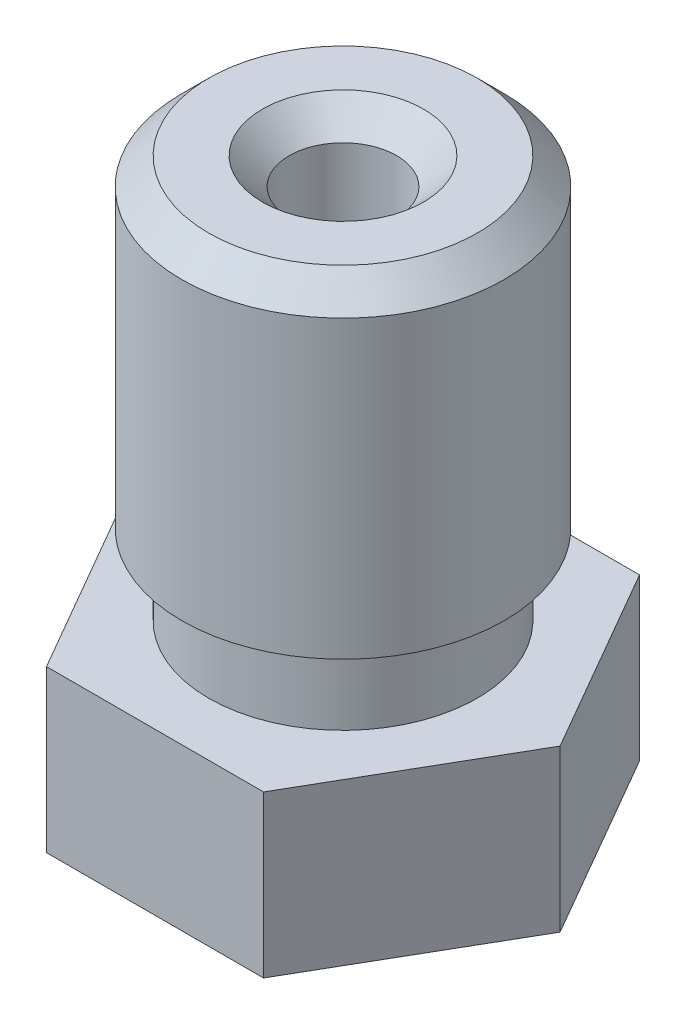
ISO-10303-21;
HEADER;
FILE_DESCRIPTION(('STEP AP214'),'2;1');
FILE_NAME('part.step','',(''),(''),'','','');
FILE_SCHEMA(('AUTOMOTIVE_DESIGN { 1 0 10303 214 1 1 1 1 }'));
ENDSEC;
DATA;
#1=APPLICATION_CONTEXT('core data for automotive mechanical design processes');
#2=APPLICATION_PROTOCOL_DEFINITION('international standard','automotive_design',2000,#1);
#3=PRODUCT_CONTEXT('',#1,'mechanical');
#4=PRODUCT('Part','Part','',(#3));
#5=PRODUCT_RELATED_PRODUCT_CATEGORY('part','',(#4));
#6=PRODUCT_DEFINITION_FORMATION('','',#4);
#7=PRODUCT_DEFINITION_CONTEXT('part definition',#1,'design');
#8=PRODUCT_DEFINITION('design','',#6,#7);
#9=PRODUCT_DEFINITION_SHAPE('','',#8);
#10=(LENGTH_UNIT() NAMED_UNIT(*) SI_UNIT(.MILLI.,.METRE.));
#11=(NAMED_UNIT(*) PLANE_ANGLE_UNIT() SI_UNIT($,.RADIAN.));
#12=(NAMED_UNIT(*) SI_UNIT($,.STERADIAN.) SOLID_ANGLE_UNIT());
#13=UNCERTAINTY_MEASURE_WITH_UNIT(LENGTH_MEASURE(1.E-05),#10,'distance_accuracy_value','');
#14=(GEOMETRIC_REPRESENTATION_CONTEXT(3) GLOBAL_UNCERTAINTY_ASSIGNED_CONTEXT((#13)) GLOBAL_UNIT_ASSIGNED_CONTEXT((#10,
#11,#12)) REPRESENTATION_CONTEXT('',''));
#15=CARTESIAN_POINT('',(0.,0.,0.));
#16=DIRECTION('',(0.,0.,1.));
#17=DIRECTION('',(1.,0.,0.));
#18=AXIS2_PLACEMENT_3D('',#15,#16,#17);
#19=CARTESIAN_POINT('',(-4.04245188432738,3.,-3.501));
#20=DIRECTION('',(0.,1.,0.));
#21=DIRECTION('',(0.,0.,1.));
#22=AXIS2_PLACEMENT_3D('',#19,#20,#21);
#23=PLANE('',#22);
#24=CARTESIAN_POINT('',(0.,3.,0.));
#25=DIRECTION('',(0.,-1.,0.));
#26=DIRECTION('',(0.,0.,-1.));
#27=AXIS2_PLACEMENT_3D('',#24,#25,#26);
#28=CIRCLE('',#27,2.5);
#29=CARTESIAN_POINT('',(0.,3.,-2.5));
#30=VERTEX_POINT('',#29);
#31=EDGE_CURVE('E20',#30,#30,#28,.F.);
#32=ORIENTED_EDGE('',*,*,#31,.F.);
#33=EDGE_LOOP('',(#32));
#34=FACE_BOUND('',#33,.T.);
#35=DIRECTION('',(0.499999999999999,0.,-0.866025403784439));
#36=VECTOR('',#35,1.);
#37=CARTESIAN_POINT('',(-3.03108891324554,3.,-1.75));
#38=LINE('',#37,#36);
#39=CARTESIAN_POINT('',(-4.04145188425521,3.,-1.24999058973485E-10));
#40=VERTEX_POINT('',#39);
#41=CARTESIAN_POINT('',(-2.02072594216369,3.,-3.5));
#42=VERTEX_POINT('',#41);
#43=EDGE_CURVE('E129',#40,#42,#38,.T.);
#44=ORIENTED_EDGE('',*,*,#43,.F.);
#45=DIRECTION('',(-0.5,0.,-0.866025403784439));
#46=VECTOR('',#45,1.);
#47=CARTESIAN_POINT('',(-3.03108891324554,3.,1.75));
#48=LINE('',#47,#46);
#49=CARTESIAN_POINT('',(-2.02072594216369,3.,3.5));
#50=VERTEX_POINT('',#49);
#51=EDGE_CURVE('E125',#50,#40,#48,.T.);
#52=ORIENTED_EDGE('',*,*,#51,.F.);
#53=DIRECTION('',(-1.,0.,0.));
#54=VECTOR('',#53,1.);
#55=CARTESIAN_POINT('',(0.,3.,3.5));
#56=LINE('',#55,#54);
#57=CARTESIAN_POINT('',(2.02072594216369,3.,3.5));
#58=VERTEX_POINT('',#57);
#59=EDGE_CURVE('E101',#58,#50,#56,.T.);
#60=ORIENTED_EDGE('',*,*,#59,.F.);
#61=DIRECTION('',(-0.499999999999999,0.,0.866025403784439));
#62=VECTOR('',#61,1.);
#63=CARTESIAN_POINT('',(3.03108891324554,3.,1.75));
#64=LINE('',#63,#62);
#65=CARTESIAN_POINT('',(4.04145188425521,3.,1.24999523671937E-10));
#66=VERTEX_POINT('',#65);
#67=EDGE_CURVE('E98',#66,#58,#64,.T.);
#68=ORIENTED_EDGE('',*,*,#67,.F.);
#69=DIRECTION('',(0.5,0.,0.866025403784439));
#70=VECTOR('',#69,1.);
#71=CARTESIAN_POINT('',(3.03108891324554,3.,-1.75));
#72=LINE('',#71,#70);
#73=CARTESIAN_POINT('',(2.02072594216369,3.,-3.5));
#74=VERTEX_POINT('',#73);
#75=EDGE_CURVE('E89',#74,#66,#72,.T.);
#76=ORIENTED_EDGE('',*,*,#75,.F.);
#77=DIRECTION('',(1.,0.,0.));
#78=VECTOR('',#77,1.);
#79=CARTESIAN_POINT('',(0.,3.,-3.5));
#80=LINE('',#79,#78);
#81=EDGE_CURVE('E134',#42,#74,#80,.T.);
#82=ORIENTED_EDGE('',*,*,#81,.F.);
#83=EDGE_LOOP('',(#44,#52,#60,#68,#76,#82));
#84=FACE_BOUND('',#83,.T.);
#85=ADVANCED_FACE('F16',(#34,#84),#23,.T.);
#86=CARTESIAN_POINT('',(-2.02172594216369,-0.000999999999999891,3.5));
#87=DIRECTION('',(0.,0.,1.));
#88=DIRECTION('',(1.,0.,0.));
#89=AXIS2_PLACEMENT_3D('',#86,#87,#88);
#90=PLANE('',#89);
#91=ORIENTED_EDGE('',*,*,#59,.T.);
#92=DIRECTION('',(0.,1.,0.));
#93=VECTOR('',#92,1.);
#94=CARTESIAN_POINT('',(-2.02072594216369,1.5,3.5));
#95=LINE('',#94,#93);
#96=CARTESIAN_POINT('',(-2.02072594216369,0.,3.5));
#97=VERTEX_POINT('',#96);
#98=EDGE_CURVE('E60',#97,#50,#95,.T.);
#99=ORIENTED_EDGE('',*,*,#98,.F.);
#100=DIRECTION('',(-1.,0.,0.));
#101=VECTOR('',#100,1.);
#102=CARTESIAN_POINT('',(0.,0.,3.5));
#103=LINE('',#102,#101);
#104=CARTESIAN_POINT('',(2.02072594216369,0.,3.5));
#105=VERTEX_POINT('',#104);
#106=EDGE_CURVE('E67',#105,#97,#103,.T.);
#107=ORIENTED_EDGE('',*,*,#106,.F.);
#108=DIRECTION('',(0.,-1.,0.));
#109=VECTOR('',#108,1.);
#110=CARTESIAN_POINT('',(2.02072594216369,1.5,3.5));
#111=LINE('',#110,#109);
#112=EDGE_CURVE('E104',#58,#105,#111,.T.);
#113=ORIENTED_EDGE('',*,*,#112,.F.);
#114=EDGE_LOOP('',(#91,#99,#107,#113));
#115=FACE_BOUND('',#114,.T.);
#116=ADVANCED_FACE('F223',(#115),#90,.T.);
#117=CARTESIAN_POINT('',(-4.04195188432738,-0.00100000000000044,-0.00086602540378341));
#118=DIRECTION('',(-0.866025403784439,0.,0.5));
#119=DIRECTION('',(0.5,0.,0.866025403784439));
#120=AXIS2_PLACEMENT_3D('',#117,#118,#119);
#121=PLANE('',#120);
#122=ORIENTED_EDGE('',*,*,#51,.T.);
#123=DIRECTION('',(0.,1.,0.));
#124=VECTOR('',#123,1.);
#125=CARTESIAN_POINT('',(-4.04145188432738,1.5,0.));
#126=LINE('',#125,#124);
#127=CARTESIAN_POINT('',(-4.04145188432738,0.,0.));
#128=VERTEX_POINT('',#127);
#129=EDGE_CURVE('E126',#128,#40,#126,.T.);
#130=ORIENTED_EDGE('',*,*,#129,.F.);
#131=DIRECTION('',(-0.5,0.,-0.866025403784438));
#132=VECTOR('',#131,1.);
#133=CARTESIAN_POINT('',(-2.02072594216369,0.,3.5));
#134=LINE('',#133,#132);
#135=EDGE_CURVE('E120',#97,#128,#134,.T.);
#136=ORIENTED_EDGE('',*,*,#135,.F.);
#137=ORIENTED_EDGE('',*,*,#98,.T.);
#138=EDGE_LOOP('',(#122,#130,#136,#137));
#139=FACE_BOUND('',#138,.T.);
#140=ADVANCED_FACE('F181',(#139),#121,.T.);
#141=CARTESIAN_POINT('',(-2.02022594216369,-0.000999999999999891,-3.50086602540379));
#142=DIRECTION('',(-0.866025403784439,0.,-0.499999999999999));
#143=DIRECTION('',(-0.499999999999999,0.,0.866025403784439));
#144=AXIS2_PLACEMENT_3D('',#141,#142,#143);
#145=PLANE('',#144);
#146=ORIENTED_EDGE('',*,*,#43,.T.);
#147=DIRECTION('',(0.,1.,0.));
#148=VECTOR('',#147,1.);
#149=CARTESIAN_POINT('',(-2.02072594216369,1.5,-3.5));
#150=LINE('',#149,#148);
#151=CARTESIAN_POINT('',(-2.02072594216369,0.,-3.5));
#152=VERTEX_POINT('',#151);
#153=EDGE_CURVE('E130',#152,#42,#150,.T.);
#154=ORIENTED_EDGE('',*,*,#153,.F.);
#155=DIRECTION('',(0.5,0.,-0.866025403784439));
#156=VECTOR('',#155,1.);
#157=CARTESIAN_POINT('',(-4.04145188432738,0.,0.));
#158=LINE('',#157,#156);
#159=EDGE_CURVE('E171',#128,#152,#158,.T.);
#160=ORIENTED_EDGE('',*,*,#159,.F.);
#161=ORIENTED_EDGE('',*,*,#129,.T.);
#162=EDGE_LOOP('',(#146,#154,#160,#161));
#163=FACE_BOUND('',#162,.T.);
#164=ADVANCED_FACE('F183',(#163),#145,.T.);
#165=CARTESIAN_POINT('',(2.02172594216369,-0.000999999999999891,-3.5));
#166=DIRECTION('',(0.,0.,-1.));
#167=DIRECTION('',(-1.,0.,0.));
#168=AXIS2_PLACEMENT_3D('',#165,#166,#167);
#169=PLANE('',#168);
#170=ORIENTED_EDGE('',*,*,#81,.T.);
#171=DIRECTION('',(0.,1.,0.));
#172=VECTOR('',#171,1.);
#173=CARTESIAN_POINT('',(2.02072594216369,1.5,-3.5));
#174=LINE('',#173,#172);
#175=CARTESIAN_POINT('',(2.02072594216369,0.,-3.5));
#176=VERTEX_POINT('',#175);
#177=EDGE_CURVE('E92',#176,#74,#174,.T.);
#178=ORIENTED_EDGE('',*,*,#177,.F.);
#179=DIRECTION('',(1.,0.,0.));
#180=VECTOR('',#179,1.);
#181=CARTESIAN_POINT('',(0.,0.,-3.5));
#182=LINE('',#181,#180);
#183=EDGE_CURVE('E116',#152,#176,#182,.T.);
#184=ORIENTED_EDGE('',*,*,#183,.F.);
#185=ORIENTED_EDGE('',*,*,#153,.T.);
#186=EDGE_LOOP('',(#170,#178,#184,#185));
#187=FACE_BOUND('',#186,.T.);
#188=ADVANCED_FACE('F186',(#187),#169,.T.);
#189=CARTESIAN_POINT('',(4.04195188432738,-0.000999999999999891,0.000866025403784064));
#190=DIRECTION('',(0.866025403784439,0.,-0.5));
#191=DIRECTION('',(-0.5,0.,-0.866025403784439));
#192=AXIS2_PLACEMENT_3D('',#189,#190,#191);
#193=PLANE('',#192);
#194=ORIENTED_EDGE('',*,*,#75,.T.);
#195=DIRECTION('',(0.,1.,0.));
#196=VECTOR('',#195,1.);
#197=CARTESIAN_POINT('',(4.04145188432738,1.5,0.));
#198=LINE('',#197,#196);
#199=CARTESIAN_POINT('',(4.04145188432738,0.,0.));
#200=VERTEX_POINT('',#199);
#201=EDGE_CURVE('E40',#200,#66,#198,.T.);
#202=ORIENTED_EDGE('',*,*,#201,.F.);
#203=DIRECTION('',(0.5,0.,0.866025403784439));
#204=VECTOR('',#203,1.);
#205=CARTESIAN_POINT('',(2.02072594216369,0.,-3.5));
#206=LINE('',#205,#204);
#207=EDGE_CURVE('E168',#176,#200,#206,.T.);
#208=ORIENTED_EDGE('',*,*,#207,.F.);
#209=ORIENTED_EDGE('',*,*,#177,.T.);
#210=EDGE_LOOP('',(#194,#202,#208,#209));
#211=FACE_BOUND('',#210,.T.);
#212=ADVANCED_FACE('F91',(#211),#193,.T.);
#213=CARTESIAN_POINT('',(2.02022594216369,-0.000999999999999891,3.50086602540379));
#214=DIRECTION('',(0.866025403784439,0.,0.499999999999999));
#215=DIRECTION('',(0.499999999999999,0.,-0.866025403784439));
#216=AXIS2_PLACEMENT_3D('',#213,#214,#215);
#217=PLANE('',#216);
#218=ORIENTED_EDGE('',*,*,#67,.T.);
#219=ORIENTED_EDGE('',*,*,#112,.T.);
#220=DIRECTION('',(-0.5,0.,0.866025403784439));
#221=VECTOR('',#220,1.);
#222=CARTESIAN_POINT('',(4.04145188432738,0.,0.));
#223=LINE('',#222,#221);
#224=EDGE_CURVE('E108',#200,#105,#223,.T.);
#225=ORIENTED_EDGE('',*,*,#224,.F.);
#226=ORIENTED_EDGE('',*,*,#201,.T.);
#227=EDGE_LOOP('',(#218,#219,#225,#226));
#228=FACE_BOUND('',#227,.T.);
#229=ADVANCED_FACE('F106',(#228),#217,.T.);
#230=CARTESIAN_POINT('',(0.,4.5,0.));
#231=DIRECTION('',(0.,-1.,0.));
#232=DIRECTION('',(0.,0.,-1.));
#233=AXIS2_PLACEMENT_3D('',#230,#231,#232);
#234=CYLINDRICAL_SURFACE('',#233,2.5);
#235=ORIENTED_EDGE('',*,*,#31,.T.);
#236=EDGE_LOOP('',(#235));
#237=FACE_BOUND('',#236,.T.);
#238=CARTESIAN_POINT('',(0.,4.5,0.));
#239=DIRECTION('',(0.,-1.,0.));
#240=DIRECTION('',(0.,0.,-1.));
#241=AXIS2_PLACEMENT_3D('',#238,#239,#240);
#242=CIRCLE('',#241,2.5);
#243=CARTESIAN_POINT('',(0.,4.5,-2.5));
#244=VERTEX_POINT('',#243);
#245=EDGE_CURVE('E162',#244,#244,#242,.F.);
#246=ORIENTED_EDGE('',*,*,#245,.F.);
#247=EDGE_LOOP('',(#246));
#248=FACE_BOUND('',#247,.T.);
#249=ADVANCED_FACE('F283',(#237,#248),#234,.T.);
#250=CARTESIAN_POINT('',(-4.04245188432738,0.,3.501));
#251=DIRECTION('',(0.,-1.,0.));
#252=DIRECTION('',(0.,0.,-1.));
#253=AXIS2_PLACEMENT_3D('',#250,#251,#252);
#254=PLANE('',#253);
#255=CARTESIAN_POINT('',(0.,0.,0.));
#256=DIRECTION('',(0.,1.,0.));
#257=DIRECTION('',(0.,0.,1.));
#258=AXIS2_PLACEMENT_3D('',#255,#256,#257);
#259=CIRCLE('',#258,2.49999999999999);
#260=CARTESIAN_POINT('',(0.,0.,2.49999999999999));
#261=VERTEX_POINT('',#260);
#262=EDGE_CURVE('E158',#261,#261,#259,.F.);
#263=ORIENTED_EDGE('',*,*,#262,.F.);
#264=EDGE_LOOP('',(#263));
#265=FACE_BOUND('',#264,.T.);
#266=ORIENTED_EDGE('',*,*,#207,.T.);
#267=ORIENTED_EDGE('',*,*,#224,.T.);
#268=ORIENTED_EDGE('',*,*,#106,.T.);
#269=ORIENTED_EDGE('',*,*,#135,.T.);
#270=ORIENTED_EDGE('',*,*,#159,.T.);
#271=ORIENTED_EDGE('',*,*,#183,.T.);
#272=EDGE_LOOP('',(#266,#267,#268,#269,#270,#271));
#273=FACE_BOUND('',#272,.T.);
#274=ADVANCED_FACE('F177',(#265,#273),#254,.T.);
#275=CARTESIAN_POINT('',(-3.001,4.5,3.001));
#276=DIRECTION('',(0.,-1.,0.));
#277=DIRECTION('',(0.,0.,-1.));
#278=AXIS2_PLACEMENT_3D('',#275,#276,#277);
#279=PLANE('',#278);
#280=ORIENTED_EDGE('',*,*,#245,.T.);
#281=EDGE_LOOP('',(#280));
#282=FACE_BOUND('',#281,.T.);
#283=CARTESIAN_POINT('',(0.,4.5,0.));
#284=DIRECTION('',(0.,-1.,0.));
#285=DIRECTION('',(0.,0.,-1.));
#286=AXIS2_PLACEMENT_3D('',#283,#284,#285);
#287=CIRCLE('',#286,3.);
#288=CARTESIAN_POINT('',(0.,4.5,-3.));
#289=VERTEX_POINT('',#288);
#290=EDGE_CURVE('E154',#289,#289,#287,.F.);
#291=ORIENTED_EDGE('',*,*,#290,.F.);
#292=EDGE_LOOP('',(#291));
#293=FACE_BOUND('',#292,.T.);
#294=ADVANCED_FACE('F278',(#282,#293),#279,.T.);
#295=CARTESIAN_POINT('',(0.,0.,0.));
#296=DIRECTION('',(0.,1.,0.));
#297=DIRECTION('',(0.,0.,1.));
#298=AXIS2_PLACEMENT_3D('',#295,#296,#297);
#299=CONICAL_SURFACE('',#298,2.49999999999999,0.785398163397446);
#300=CARTESIAN_POINT('',(0.,-2.,0.));
#301=DIRECTION('',(0.,1.,0.));
#302=DIRECTION('',(0.,0.,1.));
#303=AXIS2_PLACEMENT_3D('',#300,#301,#302);
#304=CIRCLE('',#303,0.5);
#305=CARTESIAN_POINT('',(0.,-2.,0.5));
#306=VERTEX_POINT('',#305);
#307=EDGE_CURVE('E150',#306,#306,#304,.F.);
#308=ORIENTED_EDGE('',*,*,#307,.F.);
#309=EDGE_LOOP('',(#308));
#310=FACE_BOUND('',#309,.T.);
#311=ORIENTED_EDGE('',*,*,#262,.T.);
#312=EDGE_LOOP('',(#311));
#313=FACE_BOUND('',#312,.T.);
#314=ADVANCED_FACE('F275',(#310,#313),#299,.T.);
#315=CARTESIAN_POINT('',(0.,10.,0.));
#316=DIRECTION('',(0.,-1.,0.));
#317=DIRECTION('',(0.,0.,-1.));
#318=AXIS2_PLACEMENT_3D('',#315,#316,#317);
#319=CYLINDRICAL_SURFACE('',#318,3.);
#320=ORIENTED_EDGE('',*,*,#290,.T.);
#321=EDGE_LOOP('',(#320));
#322=FACE_BOUND('',#321,.T.);
#323=CARTESIAN_POINT('',(0.,10.,0.));
#324=DIRECTION('',(0.,1.,0.));
#325=DIRECTION('',(0.,0.,1.));
#326=AXIS2_PLACEMENT_3D('',#323,#324,#325);
#327=CIRCLE('',#326,3.);
#328=CARTESIAN_POINT('',(0.,10.,3.));
#329=VERTEX_POINT('',#328);
#330=EDGE_CURVE('E149',#329,#329,#327,.T.);
#331=ORIENTED_EDGE('',*,*,#330,.F.);
#332=EDGE_LOOP('',(#331));
#333=FACE_BOUND('',#332,.T.);
#334=ADVANCED_FACE('F271',(#322,#333),#319,.T.);
#335=CARTESIAN_POINT('',(-0.501,-2.,0.501));
#336=DIRECTION('',(0.,-1.,0.));
#337=DIRECTION('',(0.,0.,-1.));
#338=AXIS2_PLACEMENT_3D('',#335,#336,#337);
#339=PLANE('',#338);
#340=CARTESIAN_POINT('',(0.,-2.,0.));
#341=DIRECTION('',(0.,1.,0.));
#342=DIRECTION('',(0.,0.,1.));
#343=AXIS2_PLACEMENT_3D('',#340,#341,#342);
#344=CIRCLE('',#343,0.2);
#345=CARTESIAN_POINT('',(0.,-2.,0.2));
#346=VERTEX_POINT('',#345);
#347=EDGE_CURVE('E145',#346,#346,#344,.F.);
#348=ORIENTED_EDGE('',*,*,#347,.F.);
#349=EDGE_LOOP('',(#348));
#350=FACE_BOUND('',#349,.T.);
#351=ORIENTED_EDGE('',*,*,#307,.T.);
#352=EDGE_LOOP('',(#351));
#353=FACE_BOUND('',#352,.T.);
#354=ADVANCED_FACE('F268',(#350,#353),#339,.T.);
#355=CARTESIAN_POINT('',(0.,10.,0.));
#356=DIRECTION('',(0.,-1.,0.));
#357=DIRECTION('',(0.,0.,-1.));
#358=AXIS2_PLACEMENT_3D('',#355,#356,#357);
#359=CONICAL_SURFACE('',#358,3.,0.785398163397448);
#360=CARTESIAN_POINT('',(0.,10.5,0.));
#361=DIRECTION('',(0.,-1.,0.));
#362=DIRECTION('',(0.,0.,-1.));
#363=AXIS2_PLACEMENT_3D('',#360,#361,#362);
#364=CIRCLE('',#363,2.5);
#365=CARTESIAN_POINT('',(0.,10.5,-2.5));
#366=VERTEX_POINT('',#365);
#367=EDGE_CURVE('E141',#366,#366,#364,.F.);
#368=ORIENTED_EDGE('',*,*,#367,.F.);
#369=EDGE_LOOP('',(#368));
#370=FACE_BOUND('',#369,.T.);
#371=ORIENTED_EDGE('',*,*,#330,.T.);
#372=EDGE_LOOP('',(#371));
#373=FACE_BOUND('',#372,.T.);
#374=ADVANCED_FACE('F264',(#370,#373),#359,.T.);
#375=CARTESIAN_POINT('',(0.,-2.,0.));
#376=DIRECTION('',(0.,1.,0.));
#377=DIRECTION('',(0.,0.,1.));
#378=AXIS2_PLACEMENT_3D('',#375,#376,#377);
#379=CYLINDRICAL_SURFACE('',#378,0.2);
#380=CARTESIAN_POINT('',(0.,-1.2,0.));
#381=DIRECTION('',(0.,-1.,0.));
#382=DIRECTION('',(0.,0.,-1.));
#383=AXIS2_PLACEMENT_3D('',#380,#381,#382);
#384=CIRCLE('',#383,0.2);
#385=CARTESIAN_POINT('',(0.,-1.2,-0.2));
#386=VERTEX_POINT('',#385);
#387=EDGE_CURVE('E140',#386,#386,#384,.T.);
#388=ORIENTED_EDGE('',*,*,#387,.F.);
#389=EDGE_LOOP('',(#388));
#390=FACE_BOUND('',#389,.T.);
#391=ORIENTED_EDGE('',*,*,#347,.T.);
#392=EDGE_LOOP('',(#391));
#393=FACE_BOUND('',#392,.T.);
#394=ADVANCED_FACE('F261',(#390,#393),#379,.F.);
#395=CARTESIAN_POINT('',(-2.501,10.5,-2.501));
#396=DIRECTION('',(0.,1.,0.));
#397=DIRECTION('',(0.,0.,1.));
#398=AXIS2_PLACEMENT_3D('',#395,#396,#397);
#399=PLANE('',#398);
#400=CARTESIAN_POINT('',(0.,10.5,0.));
#401=DIRECTION('',(0.,1.,0.));
#402=DIRECTION('',(0.,0.,1.));
#403=AXIS2_PLACEMENT_3D('',#400,#401,#402);
#404=CIRCLE('',#403,1.5);
#405=CARTESIAN_POINT('',(0.,10.5,1.5));
#406=VERTEX_POINT('',#405);
#407=EDGE_CURVE('E135',#406,#406,#404,.T.);
#408=ORIENTED_EDGE('',*,*,#407,.F.);
#409=EDGE_LOOP('',(#408));
#410=FACE_BOUND('',#409,.T.);
#411=ORIENTED_EDGE('',*,*,#367,.T.);
#412=EDGE_LOOP('',(#411));
#413=FACE_BOUND('',#412,.T.);
#414=ADVANCED_FACE('F257',(#410,#413),#399,.T.);
#415=CARTESIAN_POINT('',(0.,-1.2,0.));
#416=DIRECTION('',(0.,1.,0.));
#417=DIRECTION('',(0.,0.,1.));
#418=AXIS2_PLACEMENT_3D('',#415,#416,#417);
#419=CONICAL_SURFACE('',#418,0.2,0.832981266674434);
#420=CARTESIAN_POINT('',(0.,-0.700000000000002,0.));
#421=DIRECTION('',(0.,-1.,0.));
#422=DIRECTION('',(0.,0.,-1.));
#423=AXIS2_PLACEMENT_3D('',#420,#421,#422);
#424=CIRCLE('',#423,0.75);
#425=CARTESIAN_POINT('',(0.,-0.700000000000002,-0.75));
#426=VERTEX_POINT('',#425);
#427=EDGE_CURVE('E139',#426,#426,#424,.T.);
#428=ORIENTED_EDGE('',*,*,#427,.F.);
#429=EDGE_LOOP('',(#428));
#430=FACE_BOUND('',#429,.T.);
#431=ORIENTED_EDGE('',*,*,#387,.T.);
#432=EDGE_LOOP('',(#431));
#433=FACE_BOUND('',#432,.T.);
#434=ADVANCED_FACE('F254',(#430,#433),#419,.F.);
#435=CARTESIAN_POINT('',(0.,10.,0.));
#436=DIRECTION('',(0.,1.,0.));
#437=DIRECTION('',(0.,0.,1.));
#438=AXIS2_PLACEMENT_3D('',#435,#436,#437);
#439=CONICAL_SURFACE('',#438,1.,0.785398163397448);
#440=ORIENTED_EDGE('',*,*,#407,.T.);
#441=EDGE_LOOP('',(#440));
#442=FACE_BOUND('',#441,.T.);
#443=CARTESIAN_POINT('',(0.,10.,0.));
#444=DIRECTION('',(0.,1.,0.));
#445=DIRECTION('',(0.,0.,1.));
#446=AXIS2_PLACEMENT_3D('',#443,#444,#445);
#447=CIRCLE('',#446,1.);
#448=CARTESIAN_POINT('',(0.,10.,1.));
#449=VERTEX_POINT('',#448);
#450=EDGE_CURVE('E206',#449,#449,#447,.T.);
#451=ORIENTED_EDGE('',*,*,#450,.F.);
#452=EDGE_LOOP('',(#451));
#453=FACE_BOUND('',#452,.T.);
#454=ADVANCED_FACE('F250',(#442,#453),#439,.F.);
#455=CARTESIAN_POINT('',(0.,-0.700000000000002,0.));
#456=DIRECTION('',(0.,1.,0.));
#457=DIRECTION('',(0.,0.,1.));
#458=AXIS2_PLACEMENT_3D('',#455,#456,#457);
#459=CYLINDRICAL_SURFACE('',#458,0.75);
#460=CARTESIAN_POINT('',(0.,-0.227272727272729,0.));
#461=DIRECTION('',(0.,-1.,0.));
#462=DIRECTION('',(0.,0.,-1.));
#463=AXIS2_PLACEMENT_3D('',#460,#461,#462);
#464=CIRCLE('',#463,0.75);
#465=CARTESIAN_POINT('',(0.,-0.227272727272729,-0.75));
#466=VERTEX_POINT('',#465);
#467=EDGE_CURVE('E27',#466,#466,#464,.T.);
#468=ORIENTED_EDGE('',*,*,#467,.F.);
#469=EDGE_LOOP('',(#468));
#470=FACE_BOUND('',#469,.T.);
#471=ORIENTED_EDGE('',*,*,#427,.T.);
#472=EDGE_LOOP('',(#471));
#473=FACE_BOUND('',#472,.T.);
#474=ADVANCED_FACE('F242',(#470,#473),#459,.F.);
#475=CARTESIAN_POINT('',(0.,10.,0.));
#476=DIRECTION('',(0.,-1.,0.));
#477=DIRECTION('',(0.,0.,-1.));
#478=AXIS2_PLACEMENT_3D('',#475,#476,#477);
#479=CYLINDRICAL_SURFACE('',#478,1.);
#480=CARTESIAN_POINT('',(0.,0.,0.));
#481=DIRECTION('',(0.,1.,0.));
#482=DIRECTION('',(0.,0.,1.));
#483=AXIS2_PLACEMENT_3D('',#480,#481,#482);
#484=CIRCLE('',#483,1.);
#485=CARTESIAN_POINT('',(0.,0.,1.));
#486=VERTEX_POINT('',#485);
#487=EDGE_CURVE('E11',#486,#486,#484,.T.);
#488=ORIENTED_EDGE('',*,*,#487,.F.);
#489=EDGE_LOOP('',(#488));
#490=FACE_BOUND('',#489,.T.);
#491=ORIENTED_EDGE('',*,*,#450,.T.);
#492=EDGE_LOOP('',(#491));
#493=FACE_BOUND('',#492,.T.);
#494=ADVANCED_FACE('F236',(#490,#493),#479,.F.);
#495=CARTESIAN_POINT('',(0.,-0.227272727272729,0.));
#496=DIRECTION('',(0.,1.,0.));
#497=DIRECTION('',(0.,0.,1.));
#498=AXIS2_PLACEMENT_3D('',#495,#496,#497);
#499=CONICAL_SURFACE('',#498,0.75,0.832981266674431);
#500=ORIENTED_EDGE('',*,*,#487,.T.);
#501=EDGE_LOOP('',(#500));
#502=FACE_BOUND('',#501,.T.);
#503=ORIENTED_EDGE('',*,*,#467,.T.);
#504=EDGE_LOOP('',(#503));
#505=FACE_BOUND('',#504,.T.);
#506=ADVANCED_FACE('F18',(#502,#505),#499,.F.);
#507=CLOSED_SHELL('',(#85,#116,#140,#164,#188,#212,#229,#249,#274,#294,#314,#334,#354,#374,#394,
#414,#434,#454,#474,#494,#506));
#508=MANIFOLD_SOLID_BREP('B1',#507);
#509=ADVANCED_BREP_SHAPE_REPRESENTATION('',(#18,#508),#14);
#510=SHAPE_DEFINITION_REPRESENTATION(#9,#509);
ENDSEC;
END-ISO-10303-21;
